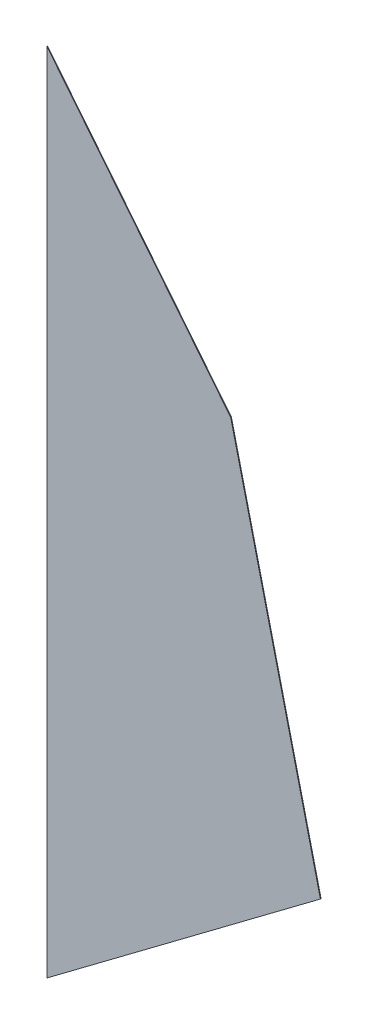
ISO-10303-21;
HEADER;
FILE_DESCRIPTION(('STEP AP214'),'2;1');
FILE_NAME('part.step','',(''),(''),'','','');
FILE_SCHEMA(('AUTOMOTIVE_DESIGN { 1 0 10303 214 1 1 1 1 }'));
ENDSEC;
DATA;
#1=APPLICATION_CONTEXT('core data for automotive mechanical design processes');
#2=APPLICATION_PROTOCOL_DEFINITION('international standard','automotive_design',2000,#1);
#3=PRODUCT_CONTEXT('',#1,'mechanical');
#4=PRODUCT('Part','Part','',(#3));
#5=PRODUCT_RELATED_PRODUCT_CATEGORY('part','',(#4));
#6=PRODUCT_DEFINITION_FORMATION('','',#4);
#7=PRODUCT_DEFINITION_CONTEXT('part definition',#1,'design');
#8=PRODUCT_DEFINITION('design','',#6,#7);
#9=PRODUCT_DEFINITION_SHAPE('','',#8);
#10=(LENGTH_UNIT() NAMED_UNIT(*) SI_UNIT(.MILLI.,.METRE.));
#11=(NAMED_UNIT(*) PLANE_ANGLE_UNIT() SI_UNIT($,.RADIAN.));
#12=(NAMED_UNIT(*) SI_UNIT($,.STERADIAN.) SOLID_ANGLE_UNIT());
#13=UNCERTAINTY_MEASURE_WITH_UNIT(LENGTH_MEASURE(1.E-05),#10,'distance_accuracy_value','');
#14=(GEOMETRIC_REPRESENTATION_CONTEXT(3) GLOBAL_UNCERTAINTY_ASSIGNED_CONTEXT((#13)) GLOBAL_UNIT_ASSIGNED_CONTEXT((#10,
#11,#12)) REPRESENTATION_CONTEXT('',''));
#15=CARTESIAN_POINT('',(0.,0.,0.));
#16=DIRECTION('',(0.,0.,1.));
#17=DIRECTION('',(1.,0.,0.));
#18=AXIS2_PLACEMENT_3D('',#15,#16,#17);
#19=CARTESIAN_POINT('',(0.,2997.2,2.54));
#20=DIRECTION('',(1.,0.,0.));
#21=DIRECTION('',(0.,1.,0.));
#22=AXIS2_PLACEMENT_3D('',#19,#20,#21);
#23=PLANE('',#22);
#24=DIRECTION('',(0.,-1.,0.));
#25=VECTOR('',#24,1.);
#26=CARTESIAN_POINT('',(0.,2997.2,0.));
#27=LINE('',#26,#25);
#28=CARTESIAN_POINT('',(0.,2997.2,0.));
#29=VERTEX_POINT('',#28);
#30=CARTESIAN_POINT('',(0.,0.,0.));
#31=VERTEX_POINT('',#30);
#32=EDGE_CURVE('E97',#29,#31,#27,.T.);
#33=ORIENTED_EDGE('',*,*,#32,.T.);
#34=DIRECTION('',(0.,0.,-1.));
#35=VECTOR('',#34,1.);
#36=CARTESIAN_POINT('',(0.,0.,2.54));
#37=LINE('',#36,#35);
#38=CARTESIAN_POINT('',(0.,0.,2.54));
#39=VERTEX_POINT('',#38);
#40=EDGE_CURVE('E11',#39,#31,#37,.T.);
#41=ORIENTED_EDGE('',*,*,#40,.F.);
#42=DIRECTION('',(0.,-1.,0.));
#43=VECTOR('',#42,1.);
#44=CARTESIAN_POINT('',(0.,2997.2,2.54));
#45=LINE('',#44,#43);
#46=CARTESIAN_POINT('',(0.,2997.2,2.54));
#47=VERTEX_POINT('',#46);
#48=EDGE_CURVE('E85',#47,#39,#45,.T.);
#49=ORIENTED_EDGE('',*,*,#48,.F.);
#50=DIRECTION('',(0.,0.,-1.));
#51=VECTOR('',#50,1.);
#52=CARTESIAN_POINT('',(0.,2997.2,2.54));
#53=LINE('',#52,#51);
#54=EDGE_CURVE('E93',#47,#29,#53,.T.);
#55=ORIENTED_EDGE('',*,*,#54,.T.);
#56=EDGE_LOOP('',(#33,#41,#49,#55));
#57=FACE_BOUND('',#56,.T.);
#58=ADVANCED_FACE('F34',(#57),#23,.F.);
#59=CARTESIAN_POINT('',(0.,0.,2.54));
#60=DIRECTION('',(-0.6,0.8,0.));
#61=DIRECTION('',(-0.8,-0.6,0.));
#62=AXIS2_PLACEMENT_3D('',#59,#60,#61);
#63=PLANE('',#62);
#64=DIRECTION('',(0.8,0.6,0.));
#65=VECTOR('',#64,1.);
#66=CARTESIAN_POINT('',(0.,0.,0.));
#67=LINE('',#66,#65);
#68=CARTESIAN_POINT('',(1016.,762.,0.));
#69=VERTEX_POINT('',#68);
#70=EDGE_CURVE('E89',#31,#69,#67,.T.);
#71=ORIENTED_EDGE('',*,*,#70,.T.);
#72=DIRECTION('',(0.,0.,-1.));
#73=VECTOR('',#72,1.);
#74=CARTESIAN_POINT('',(1016.,762.,2.54));
#75=LINE('',#74,#73);
#76=CARTESIAN_POINT('',(1016.,762.,2.54));
#77=VERTEX_POINT('',#76);
#78=EDGE_CURVE('E42',#77,#69,#75,.T.);
#79=ORIENTED_EDGE('',*,*,#78,.F.);
#80=DIRECTION('',(0.8,0.6,0.));
#81=VECTOR('',#80,1.);
#82=CARTESIAN_POINT('',(0.,0.,2.54));
#83=LINE('',#82,#81);
#84=EDGE_CURVE('E80',#39,#77,#83,.T.);
#85=ORIENTED_EDGE('',*,*,#84,.F.);
#86=ORIENTED_EDGE('',*,*,#40,.T.);
#87=EDGE_LOOP('',(#71,#79,#85,#86));
#88=FACE_BOUND('',#87,.T.);
#89=ADVANCED_FACE('F88',(#88),#63,.F.);
#90=CARTESIAN_POINT('',(1016.,762.,2.54));
#91=DIRECTION('',(-0.972200476677283,-0.234150022738549,0.));
#92=DIRECTION('',(0.234150022738549,-0.972200476677284,0.));
#93=AXIS2_PLACEMENT_3D('',#90,#91,#92);
#94=PLANE('',#93);
#95=DIRECTION('',(-0.234150022738549,0.972200476677283,0.));
#96=VECTOR('',#95,1.);
#97=CARTESIAN_POINT('',(1016.,762.,0.));
#98=LINE('',#97,#96);
#99=CARTESIAN_POINT('',(682.945007656689,2144.85795802577,0.));
#100=VERTEX_POINT('',#99);
#101=EDGE_CURVE('E67',#69,#100,#98,.T.);
#102=ORIENTED_EDGE('',*,*,#101,.T.);
#103=DIRECTION('',(0.,0.,-1.));
#104=VECTOR('',#103,1.);
#105=CARTESIAN_POINT('',(682.945007656689,2144.85795802577,2.54));
#106=LINE('',#105,#104);
#107=CARTESIAN_POINT('',(682.945007656689,2144.85795802577,2.54));
#108=VERTEX_POINT('',#107);
#109=EDGE_CURVE('E90',#108,#100,#106,.T.);
#110=ORIENTED_EDGE('',*,*,#109,.F.);
#111=DIRECTION('',(-0.234150022738549,0.972200476677283,0.));
#112=VECTOR('',#111,1.);
#113=CARTESIAN_POINT('',(1016.,762.,2.54));
#114=LINE('',#113,#112);
#115=EDGE_CURVE('E83',#77,#108,#114,.T.);
#116=ORIENTED_EDGE('',*,*,#115,.F.);
#117=ORIENTED_EDGE('',*,*,#78,.T.);
#118=EDGE_LOOP('',(#102,#110,#116,#117));
#119=FACE_BOUND('',#118,.T.);
#120=ADVANCED_FACE('F91',(#119),#94,.F.);
#121=CARTESIAN_POINT('',(682.945007656689,2144.85795802577,2.54));
#122=DIRECTION('',(-0.780390076885399,-0.625292993642821,0.));
#123=DIRECTION('',(0.625292993642821,-0.780390076885399,0.));
#124=AXIS2_PLACEMENT_3D('',#121,#122,#123);
#125=PLANE('',#124);
#126=DIRECTION('',(-0.625292993642821,0.780390076885399,0.));
#127=VECTOR('',#126,1.);
#128=CARTESIAN_POINT('',(682.945007656689,2144.85795802577,0.));
#129=LINE('',#128,#127);
#130=EDGE_CURVE('E73',#100,#29,#129,.T.);
#131=ORIENTED_EDGE('',*,*,#130,.T.);
#132=ORIENTED_EDGE('',*,*,#54,.F.);
#133=DIRECTION('',(-0.625292993642821,0.780390076885399,0.));
#134=VECTOR('',#133,1.);
#135=CARTESIAN_POINT('',(682.945007656689,2144.85795802577,2.54));
#136=LINE('',#135,#134);
#137=EDGE_CURVE('E50',#108,#47,#136,.T.);
#138=ORIENTED_EDGE('',*,*,#137,.F.);
#139=ORIENTED_EDGE('',*,*,#109,.T.);
#140=EDGE_LOOP('',(#131,#132,#138,#139));
#141=FACE_BOUND('',#140,.T.);
#142=ADVANCED_FACE('F104',(#141),#125,.F.);
#143=CARTESIAN_POINT('',(0.,0.,2.54));
#144=DIRECTION('',(0.,0.,1.));
#145=DIRECTION('',(1.,0.,0.));
#146=AXIS2_PLACEMENT_3D('',#143,#144,#145);
#147=PLANE('',#146);
#148=ORIENTED_EDGE('',*,*,#48,.T.);
#149=ORIENTED_EDGE('',*,*,#84,.T.);
#150=ORIENTED_EDGE('',*,*,#115,.T.);
#151=ORIENTED_EDGE('',*,*,#137,.T.);
#152=EDGE_LOOP('',(#148,#149,#150,#151));
#153=FACE_BOUND('',#152,.T.);
#154=ADVANCED_FACE('F81',(#153),#147,.T.);
#155=CARTESIAN_POINT('',(0.,0.,0.));
#156=DIRECTION('',(0.,0.,1.));
#157=DIRECTION('',(1.,0.,0.));
#158=AXIS2_PLACEMENT_3D('',#155,#156,#157);
#159=PLANE('',#158);
#160=ORIENTED_EDGE('',*,*,#32,.F.);
#161=ORIENTED_EDGE('',*,*,#130,.F.);
#162=ORIENTED_EDGE('',*,*,#101,.F.);
#163=ORIENTED_EDGE('',*,*,#70,.F.);
#164=EDGE_LOOP('',(#160,#161,#162,#163));
#165=FACE_BOUND('',#164,.T.);
#166=ADVANCED_FACE('F107',(#165),#159,.F.);
#167=CLOSED_SHELL('',(#58,#89,#120,#142,#154,#166));
#168=MANIFOLD_SOLID_BREP('B2',#167);
#169=ADVANCED_BREP_SHAPE_REPRESENTATION('',(#18,#168),#14);
#170=SHAPE_DEFINITION_REPRESENTATION(#9,#169);
ENDSEC;
END-ISO-10303-21;
